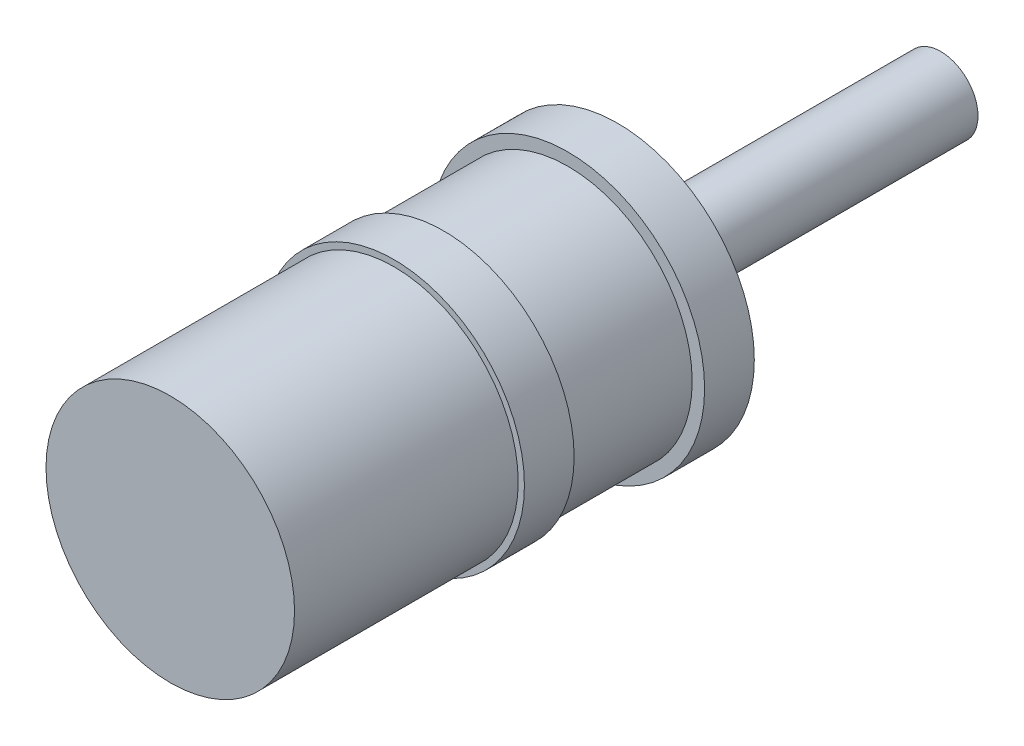
ISO-10303-21;
HEADER;
FILE_DESCRIPTION(('STEP AP214'),'2;1');
FILE_NAME('part.step','',(''),(''),'','','');
FILE_SCHEMA(('AUTOMOTIVE_DESIGN { 1 0 10303 214 1 1 1 1 }'));
ENDSEC;
DATA;
#1=APPLICATION_CONTEXT('core data for automotive mechanical design processes');
#2=APPLICATION_PROTOCOL_DEFINITION('international standard','automotive_design',2000,#1);
#3=PRODUCT_CONTEXT('',#1,'mechanical');
#4=PRODUCT('Part','Part','',(#3));
#5=PRODUCT_RELATED_PRODUCT_CATEGORY('part','',(#4));
#6=PRODUCT_DEFINITION_FORMATION('','',#4);
#7=PRODUCT_DEFINITION_CONTEXT('part definition',#1,'design');
#8=PRODUCT_DEFINITION('design','',#6,#7);
#9=PRODUCT_DEFINITION_SHAPE('','',#8);
#10=(LENGTH_UNIT() NAMED_UNIT(*) SI_UNIT(.MILLI.,.METRE.));
#11=(NAMED_UNIT(*) PLANE_ANGLE_UNIT() SI_UNIT($,.RADIAN.));
#12=(NAMED_UNIT(*) SI_UNIT($,.STERADIAN.) SOLID_ANGLE_UNIT());
#13=UNCERTAINTY_MEASURE_WITH_UNIT(LENGTH_MEASURE(1.E-05),#10,'distance_accuracy_value','');
#14=(GEOMETRIC_REPRESENTATION_CONTEXT(3) GLOBAL_UNCERTAINTY_ASSIGNED_CONTEXT((#13)) GLOBAL_UNIT_ASSIGNED_CONTEXT((#10,
#11,#12)) REPRESENTATION_CONTEXT('',''));
#15=CARTESIAN_POINT('',(0.,0.,0.));
#16=DIRECTION('',(0.,0.,1.));
#17=DIRECTION('',(1.,0.,0.));
#18=AXIS2_PLACEMENT_3D('',#15,#16,#17);
#19=CARTESIAN_POINT('',(0.,0.,3.2));
#20=DIRECTION('',(0.,0.,-1.));
#21=DIRECTION('',(-1.,0.,0.));
#22=AXIS2_PLACEMENT_3D('',#19,#20,#21);
#23=CYLINDRICAL_SURFACE('',#22,1.);
#24=CARTESIAN_POINT('',(0.,0.,0.));
#25=DIRECTION('',(0.,0.,1.));
#26=DIRECTION('',(1.,0.,0.));
#27=AXIS2_PLACEMENT_3D('',#24,#25,#26);
#28=CIRCLE('',#27,1.);
#29=CARTESIAN_POINT('',(1.,0.,0.));
#30=VERTEX_POINT('',#29);
#31=EDGE_CURVE('E50',#30,#30,#28,.T.);
#32=ORIENTED_EDGE('',*,*,#31,.T.);
#33=EDGE_LOOP('',(#32));
#34=FACE_BOUND('',#33,.T.);
#35=CARTESIAN_POINT('',(0.,0.,1.));
#36=DIRECTION('',(0.,0.,1.));
#37=DIRECTION('',(1.,0.,0.));
#38=AXIS2_PLACEMENT_3D('',#35,#36,#37);
#39=CIRCLE('',#38,1.);
#40=CARTESIAN_POINT('',(1.,0.,1.));
#41=VERTEX_POINT('',#40);
#42=EDGE_CURVE('E10',#41,#41,#39,.T.);
#43=ORIENTED_EDGE('',*,*,#42,.F.);
#44=EDGE_LOOP('',(#43));
#45=FACE_BOUND('',#44,.T.);
#46=ADVANCED_FACE('F33',(#34,#45),#23,.T.);
#47=CARTESIAN_POINT('',(0.,0.,0.));
#48=DIRECTION('',(0.,0.,1.));
#49=DIRECTION('',(1.,0.,0.));
#50=AXIS2_PLACEMENT_3D('',#47,#48,#49);
#51=PLANE('',#50);
#52=CARTESIAN_POINT('',(0.,0.,0.));
#53=DIRECTION('',(0.,0.,1.));
#54=DIRECTION('',(1.,0.,0.));
#55=AXIS2_PLACEMENT_3D('',#52,#53,#54);
#56=CIRCLE('',#55,1.1);
#57=CARTESIAN_POINT('',(1.1,0.,0.));
#58=VERTEX_POINT('',#57);
#59=EDGE_CURVE('E54',#58,#58,#56,.T.);
#60=ORIENTED_EDGE('',*,*,#59,.T.);
#61=EDGE_LOOP('',(#60));
#62=FACE_BOUND('',#61,.T.);
#63=ORIENTED_EDGE('',*,*,#31,.F.);
#64=EDGE_LOOP('',(#63));
#65=FACE_BOUND('',#64,.T.);
#66=ADVANCED_FACE('F89',(#62,#65),#51,.T.);
#67=CARTESIAN_POINT('',(0.,0.,-0.4));
#68=DIRECTION('',(0.,0.,1.));
#69=DIRECTION('',(1.,0.,0.));
#70=AXIS2_PLACEMENT_3D('',#67,#68,#69);
#71=CYLINDRICAL_SURFACE('',#70,1.1);
#72=CARTESIAN_POINT('',(0.,0.,-0.4));
#73=DIRECTION('',(0.,0.,1.));
#74=DIRECTION('',(1.,0.,0.));
#75=AXIS2_PLACEMENT_3D('',#72,#73,#74);
#76=CIRCLE('',#75,1.1);
#77=CARTESIAN_POINT('',(1.1,0.,-0.4));
#78=VERTEX_POINT('',#77);
#79=EDGE_CURVE('E57',#78,#78,#76,.T.);
#80=ORIENTED_EDGE('',*,*,#79,.T.);
#81=EDGE_LOOP('',(#80));
#82=FACE_BOUND('',#81,.T.);
#83=ORIENTED_EDGE('',*,*,#59,.F.);
#84=EDGE_LOOP('',(#83));
#85=FACE_BOUND('',#84,.T.);
#86=ADVANCED_FACE('F94',(#82,#85),#71,.T.);
#87=CARTESIAN_POINT('',(0.,0.,-0.4));
#88=DIRECTION('',(0.,0.,1.));
#89=DIRECTION('',(1.,0.,0.));
#90=AXIS2_PLACEMENT_3D('',#87,#88,#89);
#91=PLANE('',#90);
#92=ORIENTED_EDGE('',*,*,#79,.F.);
#93=EDGE_LOOP('',(#92));
#94=FACE_BOUND('',#93,.T.);
#95=CARTESIAN_POINT('',(0.,0.,-0.4));
#96=DIRECTION('',(0.,0.,1.));
#97=DIRECTION('',(1.,0.,0.));
#98=AXIS2_PLACEMENT_3D('',#95,#96,#97);
#99=CIRCLE('',#98,0.3);
#100=CARTESIAN_POINT('',(0.3,0.,-0.4));
#101=VERTEX_POINT('',#100);
#102=EDGE_CURVE('E53',#101,#101,#99,.T.);
#103=ORIENTED_EDGE('',*,*,#102,.T.);
#104=EDGE_LOOP('',(#103));
#105=FACE_BOUND('',#104,.T.);
#106=ADVANCED_FACE('F112',(#94,#105),#91,.F.);
#107=CARTESIAN_POINT('',(0.,0.,-3.));
#108=DIRECTION('',(0.,0.,1.));
#109=DIRECTION('',(1.,0.,0.));
#110=AXIS2_PLACEMENT_3D('',#107,#108,#109);
#111=PLANE('',#110);
#112=CARTESIAN_POINT('',(0.,0.,-3.));
#113=DIRECTION('',(0.,0.,1.));
#114=DIRECTION('',(1.,0.,0.));
#115=AXIS2_PLACEMENT_3D('',#112,#113,#114);
#116=CIRCLE('',#115,0.3);
#117=CARTESIAN_POINT('',(0.3,0.,-3.));
#118=VERTEX_POINT('',#117);
#119=EDGE_CURVE('E45',#118,#118,#116,.T.);
#120=ORIENTED_EDGE('',*,*,#119,.F.);
#121=EDGE_LOOP('',(#120));
#122=FACE_BOUND('',#121,.T.);
#123=ADVANCED_FACE('F108',(#122),#111,.F.);
#124=CARTESIAN_POINT('',(0.,0.,-3.));
#125=DIRECTION('',(0.,0.,1.));
#126=DIRECTION('',(1.,0.,0.));
#127=AXIS2_PLACEMENT_3D('',#124,#125,#126);
#128=CYLINDRICAL_SURFACE('',#127,0.3);
#129=ORIENTED_EDGE('',*,*,#119,.T.);
#130=EDGE_LOOP('',(#129));
#131=FACE_BOUND('',#130,.T.);
#132=ORIENTED_EDGE('',*,*,#102,.F.);
#133=EDGE_LOOP('',(#132));
#134=FACE_BOUND('',#133,.T.);
#135=ADVANCED_FACE('F85',(#131,#134),#128,.T.);
#136=CARTESIAN_POINT('',(0.,0.,1.4));
#137=DIRECTION('',(0.,0.,-1.));
#138=DIRECTION('',(-1.,0.,0.));
#139=AXIS2_PLACEMENT_3D('',#136,#137,#138);
#140=CYLINDRICAL_SURFACE('',#139,1.05);
#141=CARTESIAN_POINT('',(0.,0.,1.4));
#142=DIRECTION('',(0.,0.,1.));
#143=DIRECTION('',(1.,0.,0.));
#144=AXIS2_PLACEMENT_3D('',#141,#142,#143);
#145=CIRCLE('',#144,1.05);
#146=CARTESIAN_POINT('',(1.05,0.,1.4));
#147=VERTEX_POINT('',#146);
#148=EDGE_CURVE('E65',#147,#147,#145,.T.);
#149=ORIENTED_EDGE('',*,*,#148,.F.);
#150=EDGE_LOOP('',(#149));
#151=FACE_BOUND('',#150,.T.);
#152=CARTESIAN_POINT('',(0.,0.,1.));
#153=DIRECTION('',(0.,0.,1.));
#154=DIRECTION('',(1.,0.,0.));
#155=AXIS2_PLACEMENT_3D('',#152,#153,#154);
#156=CIRCLE('',#155,1.05);
#157=CARTESIAN_POINT('',(1.05,0.,1.));
#158=VERTEX_POINT('',#157);
#159=EDGE_CURVE('E62',#158,#158,#156,.T.);
#160=ORIENTED_EDGE('',*,*,#159,.T.);
#161=EDGE_LOOP('',(#160));
#162=FACE_BOUND('',#161,.T.);
#163=ADVANCED_FACE('F77',(#151,#162),#140,.T.);
#164=CARTESIAN_POINT('',(0.,0.,1.4));
#165=DIRECTION('',(0.,0.,1.));
#166=DIRECTION('',(1.,0.,0.));
#167=AXIS2_PLACEMENT_3D('',#164,#165,#166);
#168=PLANE('',#167);
#169=CARTESIAN_POINT('',(0.,0.,1.4));
#170=DIRECTION('',(0.,0.,1.));
#171=DIRECTION('',(1.,0.,0.));
#172=AXIS2_PLACEMENT_3D('',#169,#170,#171);
#173=CIRCLE('',#172,1.);
#174=CARTESIAN_POINT('',(1.,0.,1.4));
#175=VERTEX_POINT('',#174);
#176=EDGE_CURVE('E37',#175,#175,#173,.T.);
#177=ORIENTED_EDGE('',*,*,#176,.F.);
#178=EDGE_LOOP('',(#177));
#179=FACE_BOUND('',#178,.T.);
#180=ORIENTED_EDGE('',*,*,#148,.T.);
#181=EDGE_LOOP('',(#180));
#182=FACE_BOUND('',#181,.T.);
#183=ADVANCED_FACE('F74',(#179,#182),#168,.T.);
#184=CARTESIAN_POINT('',(0.,0.,1.));
#185=DIRECTION('',(0.,0.,1.));
#186=DIRECTION('',(1.,0.,0.));
#187=AXIS2_PLACEMENT_3D('',#184,#185,#186);
#188=PLANE('',#187);
#189=ORIENTED_EDGE('',*,*,#42,.T.);
#190=EDGE_LOOP('',(#189));
#191=FACE_BOUND('',#190,.T.);
#192=ORIENTED_EDGE('',*,*,#159,.F.);
#193=EDGE_LOOP('',(#192));
#194=FACE_BOUND('',#193,.T.);
#195=ADVANCED_FACE('F76',(#191,#194),#188,.F.);
#196=CARTESIAN_POINT('',(0.,0.,3.2));
#197=DIRECTION('',(0.,0.,1.));
#198=DIRECTION('',(1.,0.,0.));
#199=AXIS2_PLACEMENT_3D('',#196,#197,#198);
#200=PLANE('',#199);
#201=CARTESIAN_POINT('',(0.,0.,3.2));
#202=DIRECTION('',(0.,0.,1.));
#203=DIRECTION('',(1.,0.,0.));
#204=AXIS2_PLACEMENT_3D('',#201,#202,#203);
#205=CIRCLE('',#204,1.);
#206=CARTESIAN_POINT('',(1.,0.,3.2));
#207=VERTEX_POINT('',#206);
#208=EDGE_CURVE('E41',#207,#207,#205,.T.);
#209=ORIENTED_EDGE('',*,*,#208,.T.);
#210=EDGE_LOOP('',(#209));
#211=FACE_BOUND('',#210,.T.);
#212=ADVANCED_FACE('F83',(#211),#200,.T.);
#213=ORIENTED_EDGE('',*,*,#176,.T.);
#214=EDGE_LOOP('',(#213));
#215=FACE_BOUND('',#214,.T.);
#216=ORIENTED_EDGE('',*,*,#208,.F.);
#217=EDGE_LOOP('',(#216));
#218=FACE_BOUND('',#217,.T.);
#219=ADVANCED_FACE('F35',(#215,#218),#23,.T.);
#220=CLOSED_SHELL('',(#46,#66,#86,#106,#123,#135,#163,#183,#195,#212,#219));
#221=MANIFOLD_SOLID_BREP('B2',#220);
#222=ADVANCED_BREP_SHAPE_REPRESENTATION('',(#18,#221),#14);
#223=SHAPE_DEFINITION_REPRESENTATION(#9,#222);
ENDSEC;
END-ISO-10303-21;
